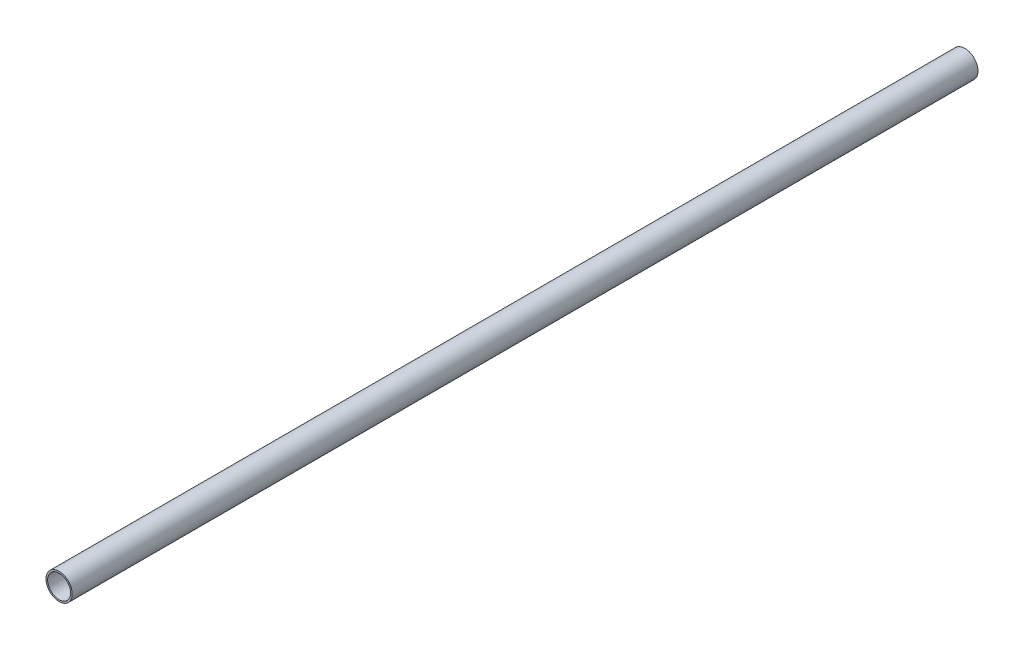
ISO-10303-21;
HEADER;
FILE_DESCRIPTION(('STEP AP214'),'2;1');
FILE_NAME('part.step','',(''),(''),'','','');
FILE_SCHEMA(('AUTOMOTIVE_DESIGN { 1 0 10303 214 1 1 1 1 }'));
ENDSEC;
DATA;
#1=APPLICATION_CONTEXT('core data for automotive mechanical design processes');
#2=APPLICATION_PROTOCOL_DEFINITION('international standard','automotive_design',2000,#1);
#3=PRODUCT_CONTEXT('',#1,'mechanical');
#4=PRODUCT('Part','Part','',(#3));
#5=PRODUCT_RELATED_PRODUCT_CATEGORY('part','',(#4));
#6=PRODUCT_DEFINITION_FORMATION('','',#4);
#7=PRODUCT_DEFINITION_CONTEXT('part definition',#1,'design');
#8=PRODUCT_DEFINITION('design','',#6,#7);
#9=PRODUCT_DEFINITION_SHAPE('','',#8);
#10=(LENGTH_UNIT() NAMED_UNIT(*) SI_UNIT(.MILLI.,.METRE.));
#11=(NAMED_UNIT(*) PLANE_ANGLE_UNIT() SI_UNIT($,.RADIAN.));
#12=(NAMED_UNIT(*) SI_UNIT($,.STERADIAN.) SOLID_ANGLE_UNIT());
#13=UNCERTAINTY_MEASURE_WITH_UNIT(LENGTH_MEASURE(1.E-05),#10,'distance_accuracy_value','');
#14=(GEOMETRIC_REPRESENTATION_CONTEXT(3) GLOBAL_UNCERTAINTY_ASSIGNED_CONTEXT((#13)) GLOBAL_UNIT_ASSIGNED_CONTEXT((#10,
#11,#12)) REPRESENTATION_CONTEXT('',''));
#15=CARTESIAN_POINT('',(0.,0.,0.));
#16=DIRECTION('',(0.,0.,1.));
#17=DIRECTION('',(1.,0.,0.));
#18=AXIS2_PLACEMENT_3D('',#15,#16,#17);
#19=CARTESIAN_POINT('',(0.,0.,552.));
#20=DIRECTION('',(0.,0.,1.));
#21=DIRECTION('',(1.,0.,0.));
#22=AXIS2_PLACEMENT_3D('',#19,#20,#21);
#23=PLANE('',#22);
#24=CARTESIAN_POINT('',(0.,0.,552.));
#25=DIRECTION('',(0.,0.,1.));
#26=DIRECTION('',(1.,0.,0.));
#27=AXIS2_PLACEMENT_3D('',#24,#25,#26);
#28=CIRCLE('',#27,8.);
#29=CARTESIAN_POINT('',(8.,0.,552.));
#30=VERTEX_POINT('',#29);
#31=EDGE_CURVE('E10',#30,#30,#28,.T.);
#32=ORIENTED_EDGE('',*,*,#31,.T.);
#33=EDGE_LOOP('',(#32));
#34=FACE_BOUND('',#33,.T.);
#35=CARTESIAN_POINT('',(0.,0.,552.));
#36=DIRECTION('',(0.,0.,1.));
#37=DIRECTION('',(1.,0.,0.));
#38=AXIS2_PLACEMENT_3D('',#35,#36,#37);
#39=CIRCLE('',#38,7.);
#40=CARTESIAN_POINT('',(7.,0.,552.));
#41=VERTEX_POINT('',#40);
#42=EDGE_CURVE('E42',#41,#41,#39,.T.);
#43=ORIENTED_EDGE('',*,*,#42,.F.);
#44=EDGE_LOOP('',(#43));
#45=FACE_BOUND('',#44,.T.);
#46=ADVANCED_FACE('F31',(#34,#45),#23,.T.);
#47=CARTESIAN_POINT('',(0.,0.,0.));
#48=DIRECTION('',(0.,0.,1.));
#49=DIRECTION('',(1.,0.,0.));
#50=AXIS2_PLACEMENT_3D('',#47,#48,#49);
#51=PLANE('',#50);
#52=CARTESIAN_POINT('',(0.,0.,0.));
#53=DIRECTION('',(0.,0.,1.));
#54=DIRECTION('',(1.,0.,0.));
#55=AXIS2_PLACEMENT_3D('',#52,#53,#54);
#56=CIRCLE('',#55,8.);
#57=CARTESIAN_POINT('',(8.,0.,0.));
#58=VERTEX_POINT('',#57);
#59=EDGE_CURVE('E35',#58,#58,#56,.T.);
#60=ORIENTED_EDGE('',*,*,#59,.F.);
#61=EDGE_LOOP('',(#60));
#62=FACE_BOUND('',#61,.T.);
#63=CARTESIAN_POINT('',(0.,0.,0.));
#64=DIRECTION('',(0.,0.,1.));
#65=DIRECTION('',(1.,0.,0.));
#66=AXIS2_PLACEMENT_3D('',#63,#64,#65);
#67=CIRCLE('',#66,7.);
#68=CARTESIAN_POINT('',(7.,0.,0.));
#69=VERTEX_POINT('',#68);
#70=EDGE_CURVE('E44',#69,#69,#67,.T.);
#71=ORIENTED_EDGE('',*,*,#70,.T.);
#72=EDGE_LOOP('',(#71));
#73=FACE_BOUND('',#72,.T.);
#74=ADVANCED_FACE('F54',(#62,#73),#51,.F.);
#75=CARTESIAN_POINT('',(0.,0.,552.));
#76=DIRECTION('',(0.,0.,-1.));
#77=DIRECTION('',(-1.,0.,0.));
#78=AXIS2_PLACEMENT_3D('',#75,#76,#77);
#79=CYLINDRICAL_SURFACE('',#78,8.);
#80=ORIENTED_EDGE('',*,*,#31,.F.);
#81=EDGE_LOOP('',(#80));
#82=FACE_BOUND('',#81,.T.);
#83=ORIENTED_EDGE('',*,*,#59,.T.);
#84=EDGE_LOOP('',(#83));
#85=FACE_BOUND('',#84,.T.);
#86=ADVANCED_FACE('F33',(#82,#85),#79,.T.);
#87=CARTESIAN_POINT('',(0.,0.,552.));
#88=DIRECTION('',(0.,0.,-1.));
#89=DIRECTION('',(-1.,0.,0.));
#90=AXIS2_PLACEMENT_3D('',#87,#88,#89);
#91=CYLINDRICAL_SURFACE('',#90,7.);
#92=ORIENTED_EDGE('',*,*,#42,.T.);
#93=EDGE_LOOP('',(#92));
#94=FACE_BOUND('',#93,.T.);
#95=ORIENTED_EDGE('',*,*,#70,.F.);
#96=EDGE_LOOP('',(#95));
#97=FACE_BOUND('',#96,.T.);
#98=ADVANCED_FACE('F50',(#94,#97),#91,.F.);
#99=CLOSED_SHELL('',(#46,#74,#86,#98));
#100=MANIFOLD_SOLID_BREP('B2',#99);
#101=ADVANCED_BREP_SHAPE_REPRESENTATION('',(#18,#100),#14);
#102=SHAPE_DEFINITION_REPRESENTATION(#9,#101);
ENDSEC;
END-ISO-10303-21;
